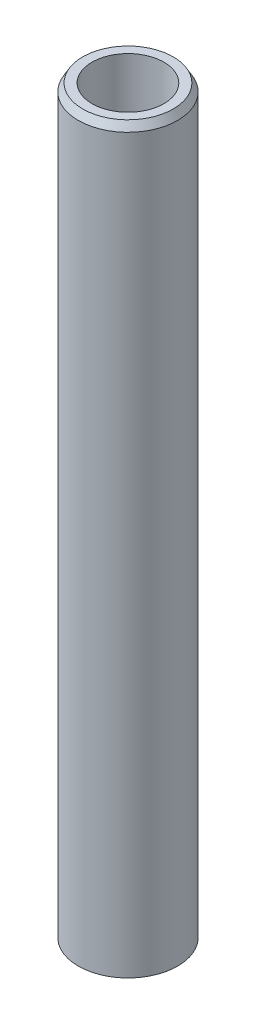
ISO-10303-21;
HEADER;
FILE_DESCRIPTION(('STEP AP214'),'2;1');
FILE_NAME('part.step','',(''),(''),'','','');
FILE_SCHEMA(('AUTOMOTIVE_DESIGN { 1 0 10303 214 1 1 1 1 }'));
ENDSEC;
DATA;
#1=APPLICATION_CONTEXT('core data for automotive mechanical design processes');
#2=APPLICATION_PROTOCOL_DEFINITION('international standard','automotive_design',2000,#1);
#3=PRODUCT_CONTEXT('',#1,'mechanical');
#4=PRODUCT('Part','Part','',(#3));
#5=PRODUCT_RELATED_PRODUCT_CATEGORY('part','',(#4));
#6=PRODUCT_DEFINITION_FORMATION('','',#4);
#7=PRODUCT_DEFINITION_CONTEXT('part definition',#1,'design');
#8=PRODUCT_DEFINITION('design','',#6,#7);
#9=PRODUCT_DEFINITION_SHAPE('','',#8);
#10=(LENGTH_UNIT() NAMED_UNIT(*) SI_UNIT(.MILLI.,.METRE.));
#11=(NAMED_UNIT(*) PLANE_ANGLE_UNIT() SI_UNIT($,.RADIAN.));
#12=(NAMED_UNIT(*) SI_UNIT($,.STERADIAN.) SOLID_ANGLE_UNIT());
#13=UNCERTAINTY_MEASURE_WITH_UNIT(LENGTH_MEASURE(1.E-05),#10,'distance_accuracy_value','');
#14=(GEOMETRIC_REPRESENTATION_CONTEXT(3) GLOBAL_UNCERTAINTY_ASSIGNED_CONTEXT((#13)) GLOBAL_UNIT_ASSIGNED_CONTEXT((#10,
#11,#12)) REPRESENTATION_CONTEXT('',''));
#15=CARTESIAN_POINT('',(0.,0.,0.));
#16=DIRECTION('',(0.,0.,1.));
#17=DIRECTION('',(1.,0.,0.));
#18=AXIS2_PLACEMENT_3D('',#15,#16,#17);
#19=CARTESIAN_POINT('',(0.,224.918572249825,0.));
#20=DIRECTION('',(0.,-1.,0.));
#21=DIRECTION('',(0.,0.,-1.));
#22=AXIS2_PLACEMENT_3D('',#19,#20,#21);
#23=CYLINDRICAL_SURFACE('',#22,15.);
#24=CARTESIAN_POINT('',(0.,222.594394125011,0.));
#25=DIRECTION('',(0.,1.,0.));
#26=DIRECTION('',(0.,0.,1.));
#27=AXIS2_PLACEMENT_3D('',#24,#25,#26);
#28=CIRCLE('',#27,15.);
#29=CARTESIAN_POINT('',(0.,222.594394125011,15.));
#30=VERTEX_POINT('',#29);
#31=EDGE_CURVE('E50',#30,#30,#28,.F.);
#32=ORIENTED_EDGE('',*,*,#31,.T.);
#33=EDGE_LOOP('',(#32));
#34=FACE_BOUND('',#33,.T.);
#35=CARTESIAN_POINT('',(0.,1.34186486600546,0.));
#36=DIRECTION('',(0.,1.,0.));
#37=DIRECTION('',(0.,0.,1.));
#38=AXIS2_PLACEMENT_3D('',#35,#36,#37);
#39=CIRCLE('',#38,15.);
#40=CARTESIAN_POINT('',(0.,1.34186486600546,15.));
#41=VERTEX_POINT('',#40);
#42=EDGE_CURVE('E51',#41,#41,#39,.T.);
#43=ORIENTED_EDGE('',*,*,#42,.T.);
#44=EDGE_LOOP('',(#43));
#45=FACE_BOUND('',#44,.T.);
#46=ADVANCED_FACE('F39',(#34,#45),#23,.T.);
#47=CARTESIAN_POINT('',(0.,224.918572249825,0.));
#48=DIRECTION('',(0.,1.,0.));
#49=DIRECTION('',(0.,0.,1.));
#50=AXIS2_PLACEMENT_3D('',#47,#48,#49);
#51=PLANE('',#50);
#52=CARTESIAN_POINT('',(0.,224.918572249825,0.));
#53=DIRECTION('',(0.,1.,0.));
#54=DIRECTION('',(0.,0.,1.));
#55=AXIS2_PLACEMENT_3D('',#52,#53,#54);
#56=CIRCLE('',#55,13.6581351339945);
#57=CARTESIAN_POINT('',(0.,224.918572249825,13.6581351339945));
#58=VERTEX_POINT('',#57);
#59=EDGE_CURVE('E54',#58,#58,#56,.T.);
#60=ORIENTED_EDGE('',*,*,#59,.T.);
#61=EDGE_LOOP('',(#60));
#62=FACE_BOUND('',#61,.T.);
#63=CARTESIAN_POINT('',(0.,224.918572249825,0.));
#64=DIRECTION('',(0.,1.,0.));
#65=DIRECTION('',(0.,0.,1.));
#66=AXIS2_PLACEMENT_3D('',#63,#64,#65);
#67=CIRCLE('',#66,10.866316905653);
#68=CARTESIAN_POINT('',(0.,224.918572249825,10.866316905653));
#69=VERTEX_POINT('',#68);
#70=EDGE_CURVE('E58',#69,#69,#67,.T.);
#71=ORIENTED_EDGE('',*,*,#70,.F.);
#72=EDGE_LOOP('',(#71));
#73=FACE_BOUND('',#72,.T.);
#74=ADVANCED_FACE('F69',(#62,#73),#51,.T.);
#75=CARTESIAN_POINT('',(0.,0.,0.));
#76=DIRECTION('',(0.,1.,0.));
#77=DIRECTION('',(0.,0.,1.));
#78=AXIS2_PLACEMENT_3D('',#75,#76,#77);
#79=PLANE('',#78);
#80=CARTESIAN_POINT('',(0.,0.,0.));
#81=DIRECTION('',(0.,1.,0.));
#82=DIRECTION('',(0.,0.,1.));
#83=AXIS2_PLACEMENT_3D('',#80,#81,#82);
#84=CIRCLE('',#83,12.6758218751869);
#85=CARTESIAN_POINT('',(0.,0.,12.6758218751869));
#86=VERTEX_POINT('',#85);
#87=EDGE_CURVE('E10',#86,#86,#84,.F.);
#88=ORIENTED_EDGE('',*,*,#87,.T.);
#89=EDGE_LOOP('',(#88));
#90=FACE_BOUND('',#89,.T.);
#91=CARTESIAN_POINT('',(0.,0.,0.));
#92=DIRECTION('',(0.,1.,0.));
#93=DIRECTION('',(0.,0.,1.));
#94=AXIS2_PLACEMENT_3D('',#91,#92,#93);
#95=CIRCLE('',#94,10.866316905653);
#96=CARTESIAN_POINT('',(0.,0.,10.866316905653));
#97=VERTEX_POINT('',#96);
#98=EDGE_CURVE('E63',#97,#97,#95,.T.);
#99=ORIENTED_EDGE('',*,*,#98,.T.);
#100=EDGE_LOOP('',(#99));
#101=FACE_BOUND('',#100,.T.);
#102=ADVANCED_FACE('F75',(#90,#101),#79,.F.);
#103=CARTESIAN_POINT('',(0.,224.918572249825,0.));
#104=DIRECTION('',(0.,-1.,0.));
#105=DIRECTION('',(0.,0.,-1.));
#106=AXIS2_PLACEMENT_3D('',#103,#104,#105);
#107=CYLINDRICAL_SURFACE('',#106,10.866316905653);
#108=ORIENTED_EDGE('',*,*,#70,.T.);
#109=EDGE_LOOP('',(#108));
#110=FACE_BOUND('',#109,.T.);
#111=ORIENTED_EDGE('',*,*,#98,.F.);
#112=EDGE_LOOP('',(#111));
#113=FACE_BOUND('',#112,.T.);
#114=ADVANCED_FACE('F70',(#110,#113),#107,.F.);
#115=CARTESIAN_POINT('',(0.,224.918572249825,0.));
#116=DIRECTION('',(0.,-1.,0.));
#117=DIRECTION('',(0.,0.,-1.));
#118=AXIS2_PLACEMENT_3D('',#115,#116,#117);
#119=CONICAL_SURFACE('',#118,13.6581351339945,0.523598775598297);
#120=ORIENTED_EDGE('',*,*,#31,.F.);
#121=EDGE_LOOP('',(#120));
#122=FACE_BOUND('',#121,.T.);
#123=ORIENTED_EDGE('',*,*,#59,.F.);
#124=EDGE_LOOP('',(#123));
#125=FACE_BOUND('',#124,.T.);
#126=ADVANCED_FACE('F81',(#122,#125),#119,.T.);
#127=CARTESIAN_POINT('',(0.,1.34186486600546,0.));
#128=DIRECTION('',(0.,1.,0.));
#129=DIRECTION('',(0.,0.,1.));
#130=AXIS2_PLACEMENT_3D('',#127,#128,#129);
#131=CONICAL_SURFACE('',#130,15.,1.04719755119661);
#132=ORIENTED_EDGE('',*,*,#87,.F.);
#133=EDGE_LOOP('',(#132));
#134=FACE_BOUND('',#133,.T.);
#135=ORIENTED_EDGE('',*,*,#42,.F.);
#136=EDGE_LOOP('',(#135));
#137=FACE_BOUND('',#136,.T.);
#138=ADVANCED_FACE('F45',(#134,#137),#131,.T.);
#139=CLOSED_SHELL('',(#46,#74,#102,#114,#126,#138));
#140=MANIFOLD_SOLID_BREP('B2',#139);
#141=ADVANCED_BREP_SHAPE_REPRESENTATION('',(#18,#140),#14);
#142=SHAPE_DEFINITION_REPRESENTATION(#9,#141);
ENDSEC;
END-ISO-10303-21;
